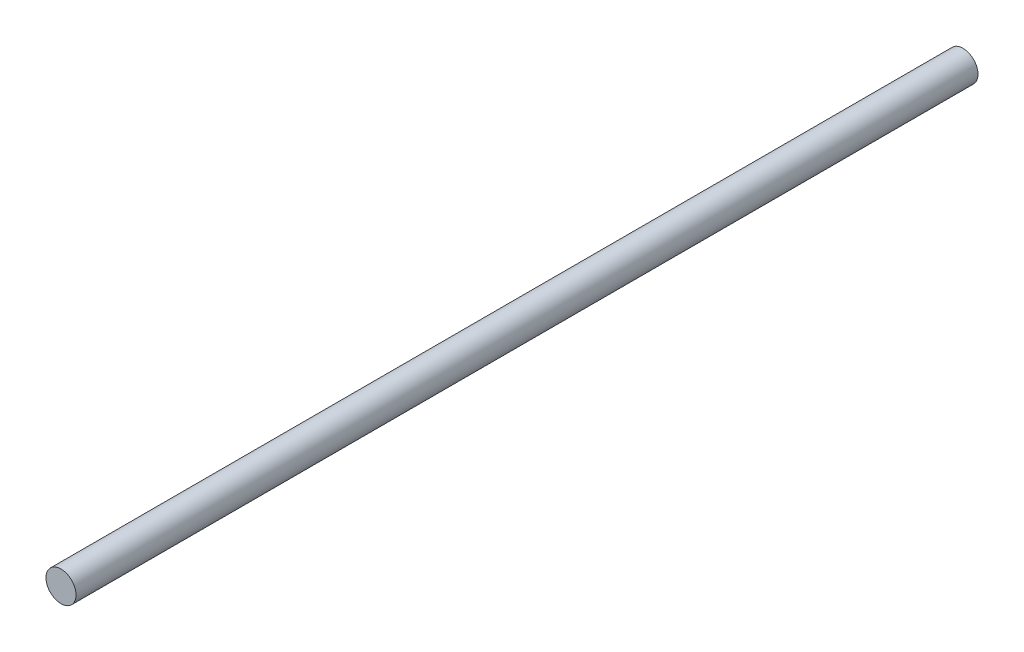
ISO-10303-21;
HEADER;
FILE_DESCRIPTION(('STEP AP214'),'2;1');
FILE_NAME('part.step','',(''),(''),'','','');
FILE_SCHEMA(('AUTOMOTIVE_DESIGN { 1 0 10303 214 1 1 1 1 }'));
ENDSEC;
DATA;
#1=APPLICATION_CONTEXT('core data for automotive mechanical design processes');
#2=APPLICATION_PROTOCOL_DEFINITION('international standard','automotive_design',2000,#1);
#3=PRODUCT_CONTEXT('',#1,'mechanical');
#4=PRODUCT('Part','Part','',(#3));
#5=PRODUCT_RELATED_PRODUCT_CATEGORY('part','',(#4));
#6=PRODUCT_DEFINITION_FORMATION('','',#4);
#7=PRODUCT_DEFINITION_CONTEXT('part definition',#1,'design');
#8=PRODUCT_DEFINITION('design','',#6,#7);
#9=PRODUCT_DEFINITION_SHAPE('','',#8);
#10=(LENGTH_UNIT() NAMED_UNIT(*) SI_UNIT(.MILLI.,.METRE.));
#11=(NAMED_UNIT(*) PLANE_ANGLE_UNIT() SI_UNIT($,.RADIAN.));
#12=(NAMED_UNIT(*) SI_UNIT($,.STERADIAN.) SOLID_ANGLE_UNIT());
#13=UNCERTAINTY_MEASURE_WITH_UNIT(LENGTH_MEASURE(1.E-05),#10,'distance_accuracy_value','');
#14=(GEOMETRIC_REPRESENTATION_CONTEXT(3) GLOBAL_UNCERTAINTY_ASSIGNED_CONTEXT((#13)) GLOBAL_UNIT_ASSIGNED_CONTEXT((#10,
#11,#12)) REPRESENTATION_CONTEXT('',''));
#15=CARTESIAN_POINT('',(0.,0.,0.));
#16=DIRECTION('',(0.,0.,1.));
#17=DIRECTION('',(1.,0.,0.));
#18=AXIS2_PLACEMENT_3D('',#15,#16,#17);
#19=CARTESIAN_POINT('',(0.,0.,240.));
#20=DIRECTION('',(0.,0.,-1.));
#21=DIRECTION('',(-1.,0.,0.));
#22=AXIS2_PLACEMENT_3D('',#19,#20,#21);
#23=CYLINDRICAL_SURFACE('',#22,4.);
#24=CARTESIAN_POINT('',(0.,0.,240.));
#25=DIRECTION('',(0.,0.,1.));
#26=DIRECTION('',(1.,0.,0.));
#27=AXIS2_PLACEMENT_3D('',#24,#25,#26);
#28=CIRCLE('',#27,4.);
#29=CARTESIAN_POINT('',(4.,0.,240.));
#30=VERTEX_POINT('',#29);
#31=EDGE_CURVE('E10',#30,#30,#28,.T.);
#32=ORIENTED_EDGE('',*,*,#31,.F.);
#33=EDGE_LOOP('',(#32));
#34=FACE_BOUND('',#33,.T.);
#35=CARTESIAN_POINT('',(0.,0.,0.));
#36=DIRECTION('',(0.,0.,1.));
#37=DIRECTION('',(1.,0.,0.));
#38=AXIS2_PLACEMENT_3D('',#35,#36,#37);
#39=CIRCLE('',#38,4.);
#40=CARTESIAN_POINT('',(4.,0.,0.));
#41=VERTEX_POINT('',#40);
#42=EDGE_CURVE('E34',#41,#41,#39,.T.);
#43=ORIENTED_EDGE('',*,*,#42,.T.);
#44=EDGE_LOOP('',(#43));
#45=FACE_BOUND('',#44,.T.);
#46=ADVANCED_FACE('F31',(#34,#45),#23,.T.);
#47=CARTESIAN_POINT('',(0.,0.,240.));
#48=DIRECTION('',(0.,0.,1.));
#49=DIRECTION('',(1.,0.,0.));
#50=AXIS2_PLACEMENT_3D('',#47,#48,#49);
#51=PLANE('',#50);
#52=ORIENTED_EDGE('',*,*,#31,.T.);
#53=EDGE_LOOP('',(#52));
#54=FACE_BOUND('',#53,.T.);
#55=ADVANCED_FACE('F46',(#54),#51,.T.);
#56=CARTESIAN_POINT('',(0.,0.,0.));
#57=DIRECTION('',(0.,0.,1.));
#58=DIRECTION('',(1.,0.,0.));
#59=AXIS2_PLACEMENT_3D('',#56,#57,#58);
#60=PLANE('',#59);
#61=ORIENTED_EDGE('',*,*,#42,.F.);
#62=EDGE_LOOP('',(#61));
#63=FACE_BOUND('',#62,.T.);
#64=ADVANCED_FACE('F44',(#63),#60,.F.);
#65=CLOSED_SHELL('',(#46,#55,#64));
#66=MANIFOLD_SOLID_BREP('B2',#65);
#67=ADVANCED_BREP_SHAPE_REPRESENTATION('',(#18,#66),#14);
#68=SHAPE_DEFINITION_REPRESENTATION(#9,#67);
ENDSEC;
END-ISO-10303-21;
